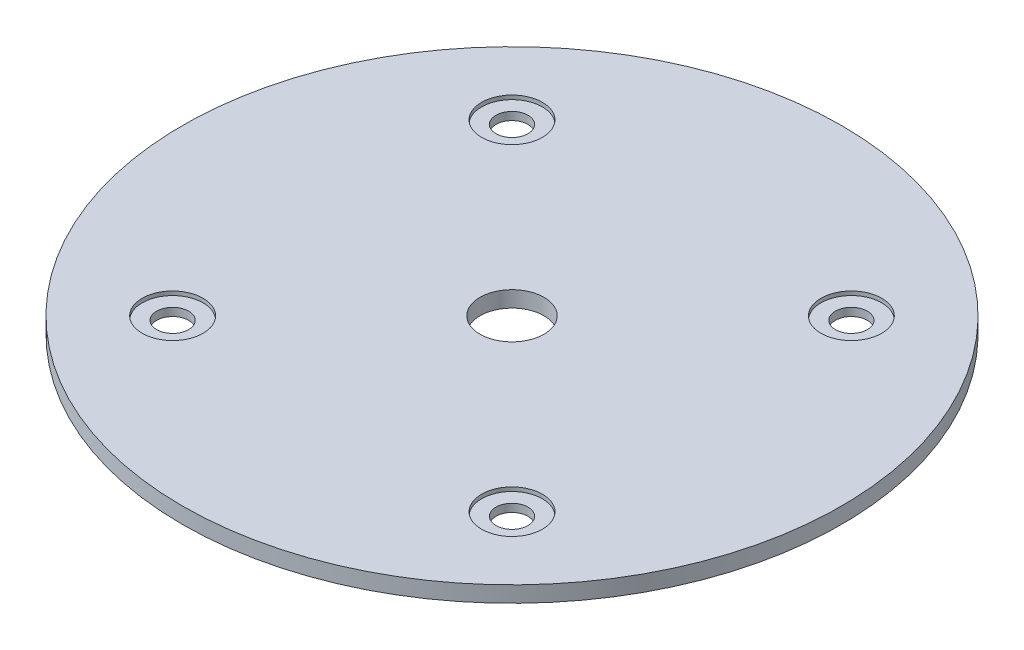
ISO-10303-21;
HEADER;
FILE_DESCRIPTION(('STEP AP214'),'2;1');
FILE_NAME('part.step','',(''),(''),'','','');
FILE_SCHEMA(('AUTOMOTIVE_DESIGN { 1 0 10303 214 1 1 1 1 }'));
ENDSEC;
DATA;
#1=APPLICATION_CONTEXT('core data for automotive mechanical design processes');
#2=APPLICATION_PROTOCOL_DEFINITION('international standard','automotive_design',2000,#1);
#3=PRODUCT_CONTEXT('',#1,'mechanical');
#4=PRODUCT('Part','Part','',(#3));
#5=PRODUCT_RELATED_PRODUCT_CATEGORY('part','',(#4));
#6=PRODUCT_DEFINITION_FORMATION('','',#4);
#7=PRODUCT_DEFINITION_CONTEXT('part definition',#1,'design');
#8=PRODUCT_DEFINITION('design','',#6,#7);
#9=PRODUCT_DEFINITION_SHAPE('','',#8);
#10=(LENGTH_UNIT() NAMED_UNIT(*) SI_UNIT(.MILLI.,.METRE.));
#11=(NAMED_UNIT(*) PLANE_ANGLE_UNIT() SI_UNIT($,.RADIAN.));
#12=(NAMED_UNIT(*) SI_UNIT($,.STERADIAN.) SOLID_ANGLE_UNIT());
#13=UNCERTAINTY_MEASURE_WITH_UNIT(LENGTH_MEASURE(1.E-05),#10,'distance_accuracy_value','');
#14=(GEOMETRIC_REPRESENTATION_CONTEXT(3) GLOBAL_UNCERTAINTY_ASSIGNED_CONTEXT((#13)) GLOBAL_UNIT_ASSIGNED_CONTEXT((#10,
#11,#12)) REPRESENTATION_CONTEXT('',''));
#15=CARTESIAN_POINT('',(0.,0.,0.));
#16=DIRECTION('',(0.,0.,1.));
#17=DIRECTION('',(1.,0.,0.));
#18=AXIS2_PLACEMENT_3D('',#15,#16,#17);
#19=CARTESIAN_POINT('',(-33.6759604540092,1.5875,33.6759604540094));
#20=DIRECTION('',(0.,1.,0.));
#21=DIRECTION('',(0.,0.,1.));
#22=AXIS2_PLACEMENT_3D('',#19,#20,#21);
#23=CYLINDRICAL_SURFACE('',#22,3.175);
#24=CARTESIAN_POINT('',(-33.6759604540092,0.79375,33.6759604540094));
#25=DIRECTION('',(0.,1.,0.));
#26=DIRECTION('',(0.,0.,1.));
#27=AXIS2_PLACEMENT_3D('',#24,#25,#26);
#28=CIRCLE('',#27,3.175);
#29=CARTESIAN_POINT('',(-33.6759604540092,0.79375,36.8509604540094));
#30=VERTEX_POINT('',#29);
#31=EDGE_CURVE('E64',#30,#30,#28,.F.);
#32=ORIENTED_EDGE('',*,*,#31,.F.);
#33=EDGE_LOOP('',(#32));
#34=FACE_BOUND('',#33,.T.);
#35=CARTESIAN_POINT('',(-33.6759604540092,-0.79375,33.6759604540094));
#36=DIRECTION('',(0.,-1.,0.));
#37=DIRECTION('',(0.,0.,-1.));
#38=AXIS2_PLACEMENT_3D('',#35,#36,#37);
#39=CIRCLE('',#38,3.175);
#40=CARTESIAN_POINT('',(-33.6759604540092,-0.79375,30.5009604540094));
#41=VERTEX_POINT('',#40);
#42=EDGE_CURVE('E40',#41,#41,#39,.F.);
#43=ORIENTED_EDGE('',*,*,#42,.F.);
#44=EDGE_LOOP('',(#43));
#45=FACE_BOUND('',#44,.T.);
#46=ADVANCED_FACE('F36',(#34,#45),#23,.F.);
#47=CARTESIAN_POINT('',(33.6759604540093,1.5875,33.6759604540092));
#48=DIRECTION('',(0.,1.,0.));
#49=DIRECTION('',(0.,0.,1.));
#50=AXIS2_PLACEMENT_3D('',#47,#48,#49);
#51=CYLINDRICAL_SURFACE('',#50,3.175);
#52=CARTESIAN_POINT('',(33.6759604540093,0.79375,33.6759604540092));
#53=DIRECTION('',(0.,1.,0.));
#54=DIRECTION('',(0.,0.,1.));
#55=AXIS2_PLACEMENT_3D('',#52,#53,#54);
#56=CIRCLE('',#55,3.175);
#57=CARTESIAN_POINT('',(33.6759604540093,0.79375,36.8509604540092));
#58=VERTEX_POINT('',#57);
#59=EDGE_CURVE('E61',#58,#58,#56,.F.);
#60=ORIENTED_EDGE('',*,*,#59,.F.);
#61=EDGE_LOOP('',(#60));
#62=FACE_BOUND('',#61,.T.);
#63=CARTESIAN_POINT('',(33.6759604540093,-0.79375,33.6759604540092));
#64=DIRECTION('',(0.,-1.,0.));
#65=DIRECTION('',(0.,0.,-1.));
#66=AXIS2_PLACEMENT_3D('',#63,#64,#65);
#67=CIRCLE('',#66,3.175);
#68=CARTESIAN_POINT('',(33.6759604540093,-0.79375,30.5009604540092));
#69=VERTEX_POINT('',#68);
#70=EDGE_CURVE('E74',#69,#69,#67,.F.);
#71=ORIENTED_EDGE('',*,*,#70,.F.);
#72=EDGE_LOOP('',(#71));
#73=FACE_BOUND('',#72,.T.);
#74=ADVANCED_FACE('F124',(#62,#73),#51,.F.);
#75=CARTESIAN_POINT('',(33.6759604540092,1.5875,-33.6759604540094));
#76=DIRECTION('',(0.,1.,0.));
#77=DIRECTION('',(0.,0.,1.));
#78=AXIS2_PLACEMENT_3D('',#75,#76,#77);
#79=CYLINDRICAL_SURFACE('',#78,3.175);
#80=CARTESIAN_POINT('',(33.6759604540092,0.79375,-33.6759604540094));
#81=DIRECTION('',(0.,1.,0.));
#82=DIRECTION('',(0.,0.,1.));
#83=AXIS2_PLACEMENT_3D('',#80,#81,#82);
#84=CIRCLE('',#83,3.175);
#85=CARTESIAN_POINT('',(33.6759604540092,0.79375,-30.5009604540094));
#86=VERTEX_POINT('',#85);
#87=EDGE_CURVE('E57',#86,#86,#84,.F.);
#88=ORIENTED_EDGE('',*,*,#87,.F.);
#89=EDGE_LOOP('',(#88));
#90=FACE_BOUND('',#89,.T.);
#91=CARTESIAN_POINT('',(33.6759604540092,-0.79375,-33.6759604540094));
#92=DIRECTION('',(0.,-1.,0.));
#93=DIRECTION('',(0.,0.,-1.));
#94=AXIS2_PLACEMENT_3D('',#91,#92,#93);
#95=CIRCLE('',#94,3.175);
#96=CARTESIAN_POINT('',(33.6759604540092,-0.79375,-36.8509604540094));
#97=VERTEX_POINT('',#96);
#98=EDGE_CURVE('E71',#97,#97,#95,.F.);
#99=ORIENTED_EDGE('',*,*,#98,.F.);
#100=EDGE_LOOP('',(#99));
#101=FACE_BOUND('',#100,.T.);
#102=ADVANCED_FACE('F131',(#90,#101),#79,.F.);
#103=CARTESIAN_POINT('',(-33.6759604540094,1.5875,-33.6759604540092));
#104=DIRECTION('',(0.,1.,0.));
#105=DIRECTION('',(0.,0.,1.));
#106=AXIS2_PLACEMENT_3D('',#103,#104,#105);
#107=CYLINDRICAL_SURFACE('',#106,3.175);
#108=CARTESIAN_POINT('',(-33.6759604540094,0.79375,-33.6759604540092));
#109=DIRECTION('',(0.,1.,0.));
#110=DIRECTION('',(0.,0.,1.));
#111=AXIS2_PLACEMENT_3D('',#108,#109,#110);
#112=CIRCLE('',#111,3.175);
#113=CARTESIAN_POINT('',(-33.6759604540094,0.79375,-30.5009604540093));
#114=VERTEX_POINT('',#113);
#115=EDGE_CURVE('E54',#114,#114,#112,.F.);
#116=ORIENTED_EDGE('',*,*,#115,.F.);
#117=EDGE_LOOP('',(#116));
#118=FACE_BOUND('',#117,.T.);
#119=CARTESIAN_POINT('',(-33.6759604540094,-0.79375,-33.6759604540092));
#120=DIRECTION('',(0.,-1.,0.));
#121=DIRECTION('',(0.,0.,-1.));
#122=AXIS2_PLACEMENT_3D('',#119,#120,#121);
#123=CIRCLE('',#122,3.175);
#124=CARTESIAN_POINT('',(-33.6759604540094,-0.79375,-36.8509604540092));
#125=VERTEX_POINT('',#124);
#126=EDGE_CURVE('E68',#125,#125,#123,.F.);
#127=ORIENTED_EDGE('',*,*,#126,.F.);
#128=EDGE_LOOP('',(#127));
#129=FACE_BOUND('',#128,.T.);
#130=ADVANCED_FACE('F141',(#118,#129),#107,.F.);
#131=CARTESIAN_POINT('',(0.,1.5875,0.));
#132=DIRECTION('',(0.,-1.,0.));
#133=DIRECTION('',(0.,0.,-1.));
#134=AXIS2_PLACEMENT_3D('',#131,#132,#133);
#135=CYLINDRICAL_SURFACE('',#134,65.405);
#136=CARTESIAN_POINT('',(0.,1.5875,0.));
#137=DIRECTION('',(0.,1.,0.));
#138=DIRECTION('',(0.,0.,1.));
#139=AXIS2_PLACEMENT_3D('',#136,#137,#138);
#140=CIRCLE('',#139,65.405);
#141=CARTESIAN_POINT('',(0.,1.5875,65.405));
#142=VERTEX_POINT('',#141);
#143=EDGE_CURVE('E10',#142,#142,#140,.T.);
#144=ORIENTED_EDGE('',*,*,#143,.F.);
#145=EDGE_LOOP('',(#144));
#146=FACE_BOUND('',#145,.T.);
#147=CARTESIAN_POINT('',(0.,-1.5875,0.));
#148=DIRECTION('',(0.,1.,0.));
#149=DIRECTION('',(0.,0.,1.));
#150=AXIS2_PLACEMENT_3D('',#147,#148,#149);
#151=CIRCLE('',#150,65.405);
#152=CARTESIAN_POINT('',(0.,-1.5875,65.405));
#153=VERTEX_POINT('',#152);
#154=EDGE_CURVE('E44',#153,#153,#151,.T.);
#155=ORIENTED_EDGE('',*,*,#154,.T.);
#156=EDGE_LOOP('',(#155));
#157=FACE_BOUND('',#156,.T.);
#158=ADVANCED_FACE('F38',(#146,#157),#135,.T.);
#159=CARTESIAN_POINT('',(0.,1.5875,0.));
#160=DIRECTION('',(0.,1.,0.));
#161=DIRECTION('',(0.,0.,1.));
#162=AXIS2_PLACEMENT_3D('',#159,#160,#161);
#163=PLANE('',#162);
#164=CARTESIAN_POINT('',(-33.6759604540092,1.5875,33.6759604540094));
#165=DIRECTION('',(0.,1.,0.));
#166=DIRECTION('',(0.,0.,1.));
#167=AXIS2_PLACEMENT_3D('',#164,#165,#166);
#168=CIRCLE('',#167,6.0325);
#169=CARTESIAN_POINT('',(-33.6759604540092,1.5875,39.7084604540094));
#170=VERTEX_POINT('',#169);
#171=EDGE_CURVE('E83',#170,#170,#168,.T.);
#172=ORIENTED_EDGE('',*,*,#171,.F.);
#173=EDGE_LOOP('',(#172));
#174=FACE_BOUND('',#173,.T.);
#175=CARTESIAN_POINT('',(33.6759604540093,1.5875,33.6759604540092));
#176=DIRECTION('',(0.,1.,0.));
#177=DIRECTION('',(0.,0.,1.));
#178=AXIS2_PLACEMENT_3D('',#175,#176,#177);
#179=CIRCLE('',#178,6.0325);
#180=CARTESIAN_POINT('',(33.6759604540093,1.5875,39.7084604540092));
#181=VERTEX_POINT('',#180);
#182=EDGE_CURVE('E148',#181,#181,#179,.T.);
#183=ORIENTED_EDGE('',*,*,#182,.F.);
#184=EDGE_LOOP('',(#183));
#185=FACE_BOUND('',#184,.T.);
#186=CARTESIAN_POINT('',(33.6759604540092,1.5875,-33.6759604540094));
#187=DIRECTION('',(0.,1.,0.));
#188=DIRECTION('',(0.,0.,1.));
#189=AXIS2_PLACEMENT_3D('',#186,#187,#188);
#190=CIRCLE('',#189,6.03249999999999);
#191=CARTESIAN_POINT('',(33.6759604540092,1.5875,-27.6434604540094));
#192=VERTEX_POINT('',#191);
#193=EDGE_CURVE('E96',#192,#192,#190,.T.);
#194=ORIENTED_EDGE('',*,*,#193,.F.);
#195=EDGE_LOOP('',(#194));
#196=FACE_BOUND('',#195,.T.);
#197=CARTESIAN_POINT('',(-33.6759604540094,1.5875,-33.6759604540092));
#198=DIRECTION('',(0.,1.,0.));
#199=DIRECTION('',(0.,0.,1.));
#200=AXIS2_PLACEMENT_3D('',#197,#198,#199);
#201=CIRCLE('',#200,6.0325);
#202=CARTESIAN_POINT('',(-33.6759604540094,1.5875,-27.6434604540092));
#203=VERTEX_POINT('',#202);
#204=EDGE_CURVE('E94',#203,#203,#201,.T.);
#205=ORIENTED_EDGE('',*,*,#204,.F.);
#206=EDGE_LOOP('',(#205));
#207=FACE_BOUND('',#206,.T.);
#208=CARTESIAN_POINT('',(0.,1.5875,0.));
#209=DIRECTION('',(0.,1.,0.));
#210=DIRECTION('',(0.,0.,1.));
#211=AXIS2_PLACEMENT_3D('',#208,#209,#210);
#212=CIRCLE('',#211,6.35);
#213=CARTESIAN_POINT('',(0.,1.5875,6.35));
#214=VERTEX_POINT('',#213);
#215=EDGE_CURVE('E67',#214,#214,#212,.T.);
#216=ORIENTED_EDGE('',*,*,#215,.F.);
#217=EDGE_LOOP('',(#216));
#218=FACE_BOUND('',#217,.T.);
#219=ORIENTED_EDGE('',*,*,#143,.T.);
#220=EDGE_LOOP('',(#219));
#221=FACE_BOUND('',#220,.T.);
#222=ADVANCED_FACE('F119',(#174,#185,#196,#207,#218,#221),#163,.T.);
#223=CARTESIAN_POINT('',(0.,-1.5875,0.));
#224=DIRECTION('',(0.,1.,0.));
#225=DIRECTION('',(0.,0.,1.));
#226=AXIS2_PLACEMENT_3D('',#223,#224,#225);
#227=PLANE('',#226);
#228=CARTESIAN_POINT('',(-33.6759604540092,-1.5875,33.6759604540094));
#229=DIRECTION('',(0.,1.,0.));
#230=DIRECTION('',(0.,0.,1.));
#231=AXIS2_PLACEMENT_3D('',#228,#229,#230);
#232=CIRCLE('',#231,6.0325);
#233=CARTESIAN_POINT('',(-33.6759604540092,-1.5875,39.7084604540094));
#234=VERTEX_POINT('',#233);
#235=EDGE_CURVE('E384',#234,#234,#232,.T.);
#236=ORIENTED_EDGE('',*,*,#235,.T.);
#237=EDGE_LOOP('',(#236));
#238=FACE_BOUND('',#237,.T.);
#239=CARTESIAN_POINT('',(33.6759604540093,-1.5875,33.6759604540092));
#240=DIRECTION('',(0.,1.,0.));
#241=DIRECTION('',(0.,0.,1.));
#242=AXIS2_PLACEMENT_3D('',#239,#240,#241);
#243=CIRCLE('',#242,6.0325);
#244=CARTESIAN_POINT('',(33.6759604540093,-1.5875,39.7084604540092));
#245=VERTEX_POINT('',#244);
#246=EDGE_CURVE('E378',#245,#245,#243,.T.);
#247=ORIENTED_EDGE('',*,*,#246,.T.);
#248=EDGE_LOOP('',(#247));
#249=FACE_BOUND('',#248,.T.);
#250=CARTESIAN_POINT('',(33.6759604540092,-1.5875,-33.6759604540094));
#251=DIRECTION('',(0.,1.,0.));
#252=DIRECTION('',(0.,0.,1.));
#253=AXIS2_PLACEMENT_3D('',#250,#251,#252);
#254=CIRCLE('',#253,6.03249999999999);
#255=CARTESIAN_POINT('',(33.6759604540092,-1.5875,-27.6434604540094));
#256=VERTEX_POINT('',#255);
#257=EDGE_CURVE('E368',#256,#256,#254,.T.);
#258=ORIENTED_EDGE('',*,*,#257,.T.);
#259=EDGE_LOOP('',(#258));
#260=FACE_BOUND('',#259,.T.);
#261=CARTESIAN_POINT('',(-33.6759604540094,-1.5875,-33.6759604540092));
#262=DIRECTION('',(0.,1.,0.));
#263=DIRECTION('',(0.,0.,1.));
#264=AXIS2_PLACEMENT_3D('',#261,#262,#263);
#265=CIRCLE('',#264,6.0325);
#266=CARTESIAN_POINT('',(-33.6759604540094,-1.5875,-27.6434604540092));
#267=VERTEX_POINT('',#266);
#268=EDGE_CURVE('E367',#267,#267,#265,.T.);
#269=ORIENTED_EDGE('',*,*,#268,.T.);
#270=EDGE_LOOP('',(#269));
#271=FACE_BOUND('',#270,.T.);
#272=CARTESIAN_POINT('',(0.,-1.5875,0.));
#273=DIRECTION('',(0.,1.,0.));
#274=DIRECTION('',(0.,0.,1.));
#275=AXIS2_PLACEMENT_3D('',#272,#273,#274);
#276=CIRCLE('',#275,6.35);
#277=CARTESIAN_POINT('',(0.,-1.5875,6.35));
#278=VERTEX_POINT('',#277);
#279=EDGE_CURVE('E49',#278,#278,#276,.T.);
#280=ORIENTED_EDGE('',*,*,#279,.T.);
#281=EDGE_LOOP('',(#280));
#282=FACE_BOUND('',#281,.T.);
#283=ORIENTED_EDGE('',*,*,#154,.F.);
#284=EDGE_LOOP('',(#283));
#285=FACE_BOUND('',#284,.T.);
#286=ADVANCED_FACE('F103',(#238,#249,#260,#271,#282,#285),#227,.F.);
#287=CARTESIAN_POINT('',(0.,1.5875,0.));
#288=DIRECTION('',(0.,1.,0.));
#289=DIRECTION('',(0.,0.,1.));
#290=AXIS2_PLACEMENT_3D('',#287,#288,#289);
#291=CYLINDRICAL_SURFACE('',#290,6.35);
#292=ORIENTED_EDGE('',*,*,#279,.F.);
#293=EDGE_LOOP('',(#292));
#294=FACE_BOUND('',#293,.T.);
#295=ORIENTED_EDGE('',*,*,#215,.T.);
#296=EDGE_LOOP('',(#295));
#297=FACE_BOUND('',#296,.T.);
#298=ADVANCED_FACE('F106',(#294,#297),#291,.F.);
#299=CARTESIAN_POINT('',(-33.6759604540094,0.79375,-33.6759604540092));
#300=DIRECTION('',(0.,1.,0.));
#301=DIRECTION('',(0.,0.,1.));
#302=AXIS2_PLACEMENT_3D('',#299,#300,#301);
#303=PLANE('',#302);
#304=CARTESIAN_POINT('',(-33.6759604540094,0.79375,-33.6759604540092));
#305=DIRECTION('',(0.,1.,0.));
#306=DIRECTION('',(0.,0.,1.));
#307=AXIS2_PLACEMENT_3D('',#304,#305,#306);
#308=CIRCLE('',#307,6.0325);
#309=CARTESIAN_POINT('',(-33.6759604540094,0.79375,-27.6434604540092));
#310=VERTEX_POINT('',#309);
#311=EDGE_CURVE('E58',#310,#310,#308,.T.);
#312=ORIENTED_EDGE('',*,*,#311,.T.);
#313=EDGE_LOOP('',(#312));
#314=FACE_BOUND('',#313,.T.);
#315=ORIENTED_EDGE('',*,*,#115,.T.);
#316=EDGE_LOOP('',(#315));
#317=FACE_BOUND('',#316,.T.);
#318=ADVANCED_FACE('F108',(#314,#317),#303,.T.);
#319=CARTESIAN_POINT('',(-33.6759604540094,0.79375,-33.6759604540092));
#320=DIRECTION('',(0.,1.,0.));
#321=DIRECTION('',(0.,0.,1.));
#322=AXIS2_PLACEMENT_3D('',#319,#320,#321);
#323=CYLINDRICAL_SURFACE('',#322,6.0325);
#324=ORIENTED_EDGE('',*,*,#311,.F.);
#325=EDGE_LOOP('',(#324));
#326=FACE_BOUND('',#325,.T.);
#327=ORIENTED_EDGE('',*,*,#204,.T.);
#328=EDGE_LOOP('',(#327));
#329=FACE_BOUND('',#328,.T.);
#330=ADVANCED_FACE('F115',(#326,#329),#323,.F.);
#331=CARTESIAN_POINT('',(33.6759604540092,0.79375,-33.6759604540094));
#332=DIRECTION('',(0.,1.,0.));
#333=DIRECTION('',(0.,0.,1.));
#334=AXIS2_PLACEMENT_3D('',#331,#332,#333);
#335=PLANE('',#334);
#336=CARTESIAN_POINT('',(33.6759604540092,0.79375,-33.6759604540094));
#337=DIRECTION('',(0.,1.,0.));
#338=DIRECTION('',(0.,0.,1.));
#339=AXIS2_PLACEMENT_3D('',#336,#337,#338);
#340=CIRCLE('',#339,6.03249999999999);
#341=CARTESIAN_POINT('',(33.6759604540092,0.79375,-27.6434604540094));
#342=VERTEX_POINT('',#341);
#343=EDGE_CURVE('E390',#342,#342,#340,.T.);
#344=ORIENTED_EDGE('',*,*,#343,.T.);
#345=EDGE_LOOP('',(#344));
#346=FACE_BOUND('',#345,.T.);
#347=ORIENTED_EDGE('',*,*,#87,.T.);
#348=EDGE_LOOP('',(#347));
#349=FACE_BOUND('',#348,.T.);
#350=ADVANCED_FACE('F156',(#346,#349),#335,.T.);
#351=CARTESIAN_POINT('',(33.6759604540092,0.79375,-33.6759604540094));
#352=DIRECTION('',(0.,1.,0.));
#353=DIRECTION('',(0.,0.,1.));
#354=AXIS2_PLACEMENT_3D('',#351,#352,#353);
#355=CYLINDRICAL_SURFACE('',#354,6.03249999999999);
#356=ORIENTED_EDGE('',*,*,#343,.F.);
#357=EDGE_LOOP('',(#356));
#358=FACE_BOUND('',#357,.T.);
#359=ORIENTED_EDGE('',*,*,#193,.T.);
#360=EDGE_LOOP('',(#359));
#361=FACE_BOUND('',#360,.T.);
#362=ADVANCED_FACE('F161',(#358,#361),#355,.F.);
#363=CARTESIAN_POINT('',(33.6759604540093,0.79375,33.6759604540092));
#364=DIRECTION('',(0.,1.,0.));
#365=DIRECTION('',(0.,0.,1.));
#366=AXIS2_PLACEMENT_3D('',#363,#364,#365);
#367=PLANE('',#366);
#368=CARTESIAN_POINT('',(33.6759604540093,0.79375,33.6759604540092));
#369=DIRECTION('',(0.,1.,0.));
#370=DIRECTION('',(0.,0.,1.));
#371=AXIS2_PLACEMENT_3D('',#368,#369,#370);
#372=CIRCLE('',#371,6.0325);
#373=CARTESIAN_POINT('',(33.6759604540093,0.79375,39.7084604540092));
#374=VERTEX_POINT('',#373);
#375=EDGE_CURVE('E88',#374,#374,#372,.T.);
#376=ORIENTED_EDGE('',*,*,#375,.T.);
#377=EDGE_LOOP('',(#376));
#378=FACE_BOUND('',#377,.T.);
#379=ORIENTED_EDGE('',*,*,#59,.T.);
#380=EDGE_LOOP('',(#379));
#381=FACE_BOUND('',#380,.T.);
#382=ADVANCED_FACE('F174',(#378,#381),#367,.T.);
#383=CARTESIAN_POINT('',(33.6759604540093,0.79375,33.6759604540092));
#384=DIRECTION('',(0.,1.,0.));
#385=DIRECTION('',(0.,0.,1.));
#386=AXIS2_PLACEMENT_3D('',#383,#384,#385);
#387=CYLINDRICAL_SURFACE('',#386,6.0325);
#388=ORIENTED_EDGE('',*,*,#375,.F.);
#389=EDGE_LOOP('',(#388));
#390=FACE_BOUND('',#389,.T.);
#391=ORIENTED_EDGE('',*,*,#182,.T.);
#392=EDGE_LOOP('',(#391));
#393=FACE_BOUND('',#392,.T.);
#394=ADVANCED_FACE('F170',(#390,#393),#387,.F.);
#395=CARTESIAN_POINT('',(-33.6759604540092,0.79375,33.6759604540094));
#396=DIRECTION('',(0.,1.,0.));
#397=DIRECTION('',(0.,0.,1.));
#398=AXIS2_PLACEMENT_3D('',#395,#396,#397);
#399=PLANE('',#398);
#400=CARTESIAN_POINT('',(-33.6759604540092,0.79375,33.6759604540094));
#401=DIRECTION('',(0.,1.,0.));
#402=DIRECTION('',(0.,0.,1.));
#403=AXIS2_PLACEMENT_3D('',#400,#401,#402);
#404=CIRCLE('',#403,6.0325);
#405=CARTESIAN_POINT('',(-33.6759604540092,0.79375,39.7084604540094));
#406=VERTEX_POINT('',#405);
#407=EDGE_CURVE('E79',#406,#406,#404,.T.);
#408=ORIENTED_EDGE('',*,*,#407,.T.);
#409=EDGE_LOOP('',(#408));
#410=FACE_BOUND('',#409,.T.);
#411=ORIENTED_EDGE('',*,*,#31,.T.);
#412=EDGE_LOOP('',(#411));
#413=FACE_BOUND('',#412,.T.);
#414=ADVANCED_FACE('F166',(#410,#413),#399,.T.);
#415=CARTESIAN_POINT('',(-33.6759604540092,0.79375,33.6759604540094));
#416=DIRECTION('',(0.,1.,0.));
#417=DIRECTION('',(0.,0.,1.));
#418=AXIS2_PLACEMENT_3D('',#415,#416,#417);
#419=CYLINDRICAL_SURFACE('',#418,6.0325);
#420=ORIENTED_EDGE('',*,*,#407,.F.);
#421=EDGE_LOOP('',(#420));
#422=FACE_BOUND('',#421,.T.);
#423=ORIENTED_EDGE('',*,*,#171,.T.);
#424=EDGE_LOOP('',(#423));
#425=FACE_BOUND('',#424,.T.);
#426=ADVANCED_FACE('F169',(#422,#425),#419,.F.);
#427=CARTESIAN_POINT('',(-33.6759604540094,-0.79375,-33.6759604540092));
#428=DIRECTION('',(0.,-1.,0.));
#429=DIRECTION('',(0.,0.,1.));
#430=AXIS2_PLACEMENT_3D('',#427,#428,#429);
#431=PLANE('',#430);
#432=CARTESIAN_POINT('',(-33.6759604540094,-0.79375,-33.6759604540092));
#433=DIRECTION('',(0.,1.,0.));
#434=DIRECTION('',(0.,0.,1.));
#435=AXIS2_PLACEMENT_3D('',#432,#433,#434);
#436=CIRCLE('',#435,6.0325);
#437=CARTESIAN_POINT('',(-33.6759604540094,-0.79375,-27.6434604540092));
#438=VERTEX_POINT('',#437);
#439=EDGE_CURVE('E72',#438,#438,#436,.T.);
#440=ORIENTED_EDGE('',*,*,#439,.F.);
#441=EDGE_LOOP('',(#440));
#442=FACE_BOUND('',#441,.T.);
#443=ORIENTED_EDGE('',*,*,#126,.T.);
#444=EDGE_LOOP('',(#443));
#445=FACE_BOUND('',#444,.T.);
#446=ADVANCED_FACE('F172',(#442,#445),#431,.T.);
#447=CARTESIAN_POINT('',(-33.6759604540094,-0.79375,-33.6759604540092));
#448=DIRECTION('',(0.,-1.,0.));
#449=DIRECTION('',(0.,0.,-1.));
#450=AXIS2_PLACEMENT_3D('',#447,#448,#449);
#451=CYLINDRICAL_SURFACE('',#450,6.0325);
#452=ORIENTED_EDGE('',*,*,#439,.T.);
#453=EDGE_LOOP('',(#452));
#454=FACE_BOUND('',#453,.T.);
#455=ORIENTED_EDGE('',*,*,#268,.F.);
#456=EDGE_LOOP('',(#455));
#457=FACE_BOUND('',#456,.T.);
#458=ADVANCED_FACE('F184',(#454,#457),#451,.F.);
#459=CARTESIAN_POINT('',(33.6759604540092,-0.79375,-33.6759604540094));
#460=DIRECTION('',(0.,-1.,0.));
#461=DIRECTION('',(0.,0.,1.));
#462=AXIS2_PLACEMENT_3D('',#459,#460,#461);
#463=PLANE('',#462);
#464=CARTESIAN_POINT('',(33.6759604540092,-0.79375,-33.6759604540094));
#465=DIRECTION('',(0.,1.,0.));
#466=DIRECTION('',(0.,0.,1.));
#467=AXIS2_PLACEMENT_3D('',#464,#465,#466);
#468=CIRCLE('',#467,6.03249999999999);
#469=CARTESIAN_POINT('',(33.6759604540092,-0.79375,-27.6434604540094));
#470=VERTEX_POINT('',#469);
#471=EDGE_CURVE('E219',#470,#470,#468,.T.);
#472=ORIENTED_EDGE('',*,*,#471,.F.);
#473=EDGE_LOOP('',(#472));
#474=FACE_BOUND('',#473,.T.);
#475=ORIENTED_EDGE('',*,*,#98,.T.);
#476=EDGE_LOOP('',(#475));
#477=FACE_BOUND('',#476,.T.);
#478=ADVANCED_FACE('F187',(#474,#477),#463,.T.);
#479=CARTESIAN_POINT('',(33.6759604540092,-0.79375,-33.6759604540094));
#480=DIRECTION('',(0.,-1.,0.));
#481=DIRECTION('',(0.,0.,-1.));
#482=AXIS2_PLACEMENT_3D('',#479,#480,#481);
#483=CYLINDRICAL_SURFACE('',#482,6.03249999999999);
#484=ORIENTED_EDGE('',*,*,#471,.T.);
#485=EDGE_LOOP('',(#484));
#486=FACE_BOUND('',#485,.T.);
#487=ORIENTED_EDGE('',*,*,#257,.F.);
#488=EDGE_LOOP('',(#487));
#489=FACE_BOUND('',#488,.T.);
#490=ADVANCED_FACE('F207',(#486,#489),#483,.F.);
#491=CARTESIAN_POINT('',(33.6759604540093,-0.79375,33.6759604540092));
#492=DIRECTION('',(0.,-1.,0.));
#493=DIRECTION('',(0.,0.,1.));
#494=AXIS2_PLACEMENT_3D('',#491,#492,#493);
#495=PLANE('',#494);
#496=CARTESIAN_POINT('',(33.6759604540093,-0.79375,33.6759604540092));
#497=DIRECTION('',(0.,1.,0.));
#498=DIRECTION('',(0.,0.,1.));
#499=AXIS2_PLACEMENT_3D('',#496,#497,#498);
#500=CIRCLE('',#499,6.0325);
#501=CARTESIAN_POINT('',(33.6759604540093,-0.79375,39.7084604540092));
#502=VERTEX_POINT('',#501);
#503=EDGE_CURVE('E373',#502,#502,#500,.T.);
#504=ORIENTED_EDGE('',*,*,#503,.F.);
#505=EDGE_LOOP('',(#504));
#506=FACE_BOUND('',#505,.T.);
#507=ORIENTED_EDGE('',*,*,#70,.T.);
#508=EDGE_LOOP('',(#507));
#509=FACE_BOUND('',#508,.T.);
#510=ADVANCED_FACE('F203',(#506,#509),#495,.T.);
#511=CARTESIAN_POINT('',(33.6759604540093,-0.79375,33.6759604540092));
#512=DIRECTION('',(0.,-1.,0.));
#513=DIRECTION('',(0.,0.,-1.));
#514=AXIS2_PLACEMENT_3D('',#511,#512,#513);
#515=CYLINDRICAL_SURFACE('',#514,6.0325);
#516=ORIENTED_EDGE('',*,*,#503,.T.);
#517=EDGE_LOOP('',(#516));
#518=FACE_BOUND('',#517,.T.);
#519=ORIENTED_EDGE('',*,*,#246,.F.);
#520=EDGE_LOOP('',(#519));
#521=FACE_BOUND('',#520,.T.);
#522=ADVANCED_FACE('F199',(#518,#521),#515,.F.);
#523=CARTESIAN_POINT('',(-33.6759604540092,-0.79375,33.6759604540094));
#524=DIRECTION('',(0.,-1.,0.));
#525=DIRECTION('',(0.,0.,1.));
#526=AXIS2_PLACEMENT_3D('',#523,#524,#525);
#527=PLANE('',#526);
#528=CARTESIAN_POINT('',(-33.6759604540092,-0.79375,33.6759604540094));
#529=DIRECTION('',(0.,1.,0.));
#530=DIRECTION('',(0.,0.,1.));
#531=AXIS2_PLACEMENT_3D('',#528,#529,#530);
#532=CIRCLE('',#531,6.0325);
#533=CARTESIAN_POINT('',(-33.6759604540092,-0.79375,39.7084604540094));
#534=VERTEX_POINT('',#533);
#535=EDGE_CURVE('E381',#534,#534,#532,.T.);
#536=ORIENTED_EDGE('',*,*,#535,.F.);
#537=EDGE_LOOP('',(#536));
#538=FACE_BOUND('',#537,.T.);
#539=ORIENTED_EDGE('',*,*,#42,.T.);
#540=EDGE_LOOP('',(#539));
#541=FACE_BOUND('',#540,.T.);
#542=ADVANCED_FACE('F195',(#538,#541),#527,.T.);
#543=CARTESIAN_POINT('',(-33.6759604540092,-0.79375,33.6759604540094));
#544=DIRECTION('',(0.,-1.,0.));
#545=DIRECTION('',(0.,0.,-1.));
#546=AXIS2_PLACEMENT_3D('',#543,#544,#545);
#547=CYLINDRICAL_SURFACE('',#546,6.0325);
#548=ORIENTED_EDGE('',*,*,#535,.T.);
#549=EDGE_LOOP('',(#548));
#550=FACE_BOUND('',#549,.T.);
#551=ORIENTED_EDGE('',*,*,#235,.F.);
#552=EDGE_LOOP('',(#551));
#553=FACE_BOUND('',#552,.T.);
#554=ADVANCED_FACE('F192',(#550,#553),#547,.F.);
#555=CLOSED_SHELL('',(#46,#74,#102,#130,#158,#222,#286,#298,#318,#330,#350,#362,#382,#394,#414,
#426,#446,#458,#478,#490,#510,#522,#542,#554));
#556=MANIFOLD_SOLID_BREP('B2',#555);
#557=ADVANCED_BREP_SHAPE_REPRESENTATION('',(#18,#556),#14);
#558=SHAPE_DEFINITION_REPRESENTATION(#9,#557);
ENDSEC;
END-ISO-10303-21;
